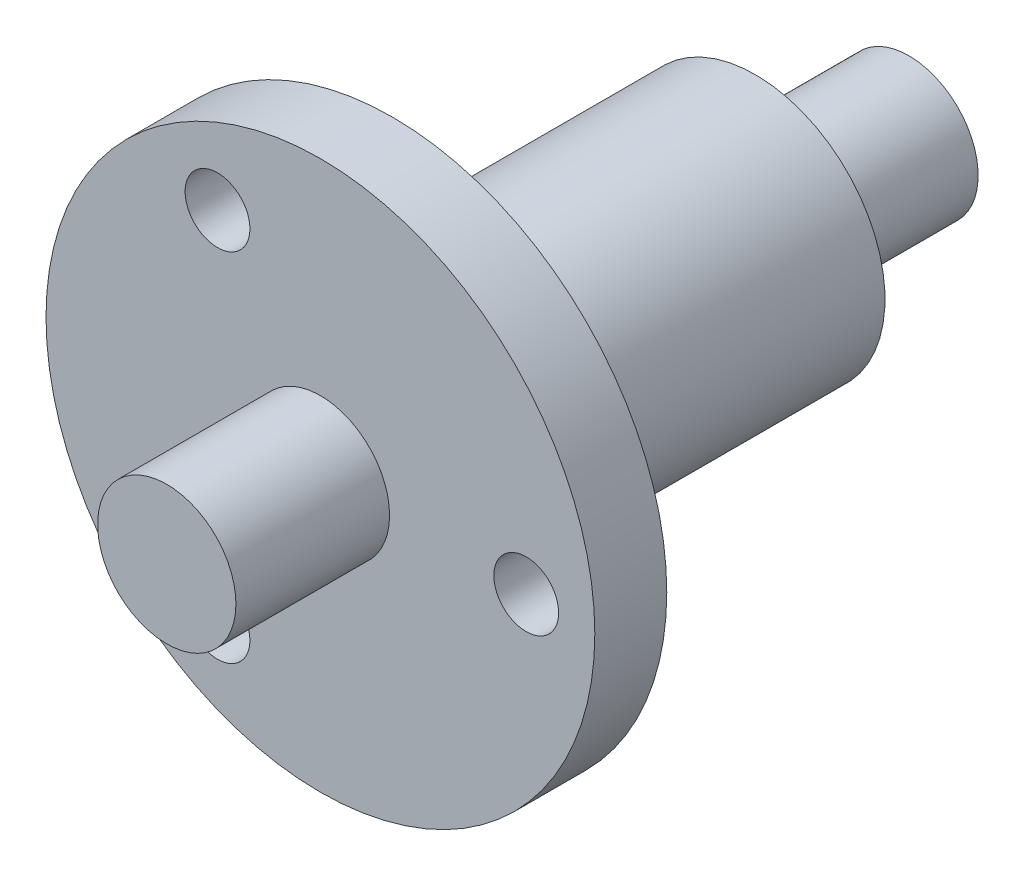
ISO-10303-21;
HEADER;
FILE_DESCRIPTION(('STEP AP214'),'2;1');
FILE_NAME('part.step','',(''),(''),'','','');
FILE_SCHEMA(('AUTOMOTIVE_DESIGN { 1 0 10303 214 1 1 1 1 }'));
ENDSEC;
DATA;
#1=APPLICATION_CONTEXT('core data for automotive mechanical design processes');
#2=APPLICATION_PROTOCOL_DEFINITION('international standard','automotive_design',2000,#1);
#3=PRODUCT_CONTEXT('',#1,'mechanical');
#4=PRODUCT('Part','Part','',(#3));
#5=PRODUCT_RELATED_PRODUCT_CATEGORY('part','',(#4));
#6=PRODUCT_DEFINITION_FORMATION('','',#4);
#7=PRODUCT_DEFINITION_CONTEXT('part definition',#1,'design');
#8=PRODUCT_DEFINITION('design','',#6,#7);
#9=PRODUCT_DEFINITION_SHAPE('','',#8);
#10=(LENGTH_UNIT() NAMED_UNIT(*) SI_UNIT(.MILLI.,.METRE.));
#11=(NAMED_UNIT(*) PLANE_ANGLE_UNIT() SI_UNIT($,.RADIAN.));
#12=(NAMED_UNIT(*) SI_UNIT($,.STERADIAN.) SOLID_ANGLE_UNIT());
#13=UNCERTAINTY_MEASURE_WITH_UNIT(LENGTH_MEASURE(1.E-05),#10,'distance_accuracy_value','');
#14=(GEOMETRIC_REPRESENTATION_CONTEXT(3) GLOBAL_UNCERTAINTY_ASSIGNED_CONTEXT((#13)) GLOBAL_UNIT_ASSIGNED_CONTEXT((#10,
#11,#12)) REPRESENTATION_CONTEXT('',''));
#15=CARTESIAN_POINT('',(0.,0.,0.));
#16=DIRECTION('',(0.,0.,1.));
#17=DIRECTION('',(1.,0.,0.));
#18=AXIS2_PLACEMENT_3D('',#15,#16,#17);
#19=CARTESIAN_POINT('',(0.,0.,3.33));
#20=DIRECTION('',(0.,0.,-1.));
#21=DIRECTION('',(-1.,0.,0.));
#22=AXIS2_PLACEMENT_3D('',#19,#20,#21);
#23=CYLINDRICAL_SURFACE('',#22,12.7);
#24=CARTESIAN_POINT('',(0.,0.,3.33));
#25=DIRECTION('',(0.,0.,1.));
#26=DIRECTION('',(1.,0.,0.));
#27=AXIS2_PLACEMENT_3D('',#24,#25,#26);
#28=CIRCLE('',#27,12.7);
#29=CARTESIAN_POINT('',(12.7,0.,3.33));
#30=VERTEX_POINT('',#29);
#31=EDGE_CURVE('E69',#30,#30,#28,.T.);
#32=ORIENTED_EDGE('',*,*,#31,.F.);
#33=EDGE_LOOP('',(#32));
#34=FACE_BOUND('',#33,.T.);
#35=CARTESIAN_POINT('',(0.,0.,0.));
#36=DIRECTION('',(0.,0.,1.));
#37=DIRECTION('',(1.,0.,0.));
#38=AXIS2_PLACEMENT_3D('',#35,#36,#37);
#39=CIRCLE('',#38,12.7);
#40=CARTESIAN_POINT('',(12.7,0.,0.));
#41=VERTEX_POINT('',#40);
#42=EDGE_CURVE('E65',#41,#41,#39,.T.);
#43=ORIENTED_EDGE('',*,*,#42,.T.);
#44=EDGE_LOOP('',(#43));
#45=FACE_BOUND('',#44,.T.);
#46=ADVANCED_FACE('F37',(#34,#45),#23,.T.);
#47=CARTESIAN_POINT('',(0.,0.,3.33));
#48=DIRECTION('',(0.,0.,1.));
#49=DIRECTION('',(1.,0.,0.));
#50=AXIS2_PLACEMENT_3D('',#47,#48,#49);
#51=PLANE('',#50);
#52=CARTESIAN_POINT('',(9.525,0.,3.33));
#53=DIRECTION('',(0.,0.,1.));
#54=DIRECTION('',(1.,0.,0.));
#55=AXIS2_PLACEMENT_3D('',#52,#53,#54);
#56=CIRCLE('',#55,1.5);
#57=CARTESIAN_POINT('',(11.025,0.,3.33));
#58=VERTEX_POINT('',#57);
#59=EDGE_CURVE('E80',#58,#58,#56,.T.);
#60=ORIENTED_EDGE('',*,*,#59,.F.);
#61=EDGE_LOOP('',(#60));
#62=FACE_BOUND('',#61,.T.);
#63=CARTESIAN_POINT('',(-4.76250000000004,-8.24889197104676,3.33));
#64=DIRECTION('',(0.,0.,1.));
#65=DIRECTION('',(1.,0.,0.));
#66=AXIS2_PLACEMENT_3D('',#63,#64,#65);
#67=CIRCLE('',#66,1.5);
#68=CARTESIAN_POINT('',(-3.26250000000004,-8.24889197104676,3.33));
#69=VERTEX_POINT('',#68);
#70=EDGE_CURVE('E221',#69,#69,#67,.T.);
#71=ORIENTED_EDGE('',*,*,#70,.F.);
#72=EDGE_LOOP('',(#71));
#73=FACE_BOUND('',#72,.T.);
#74=CARTESIAN_POINT('',(-4.76249999999992,8.24889197104682,3.33));
#75=DIRECTION('',(0.,0.,1.));
#76=DIRECTION('',(1.,0.,0.));
#77=AXIS2_PLACEMENT_3D('',#74,#75,#76);
#78=CIRCLE('',#77,1.5);
#79=CARTESIAN_POINT('',(-3.26249999999993,8.24889197104682,3.33));
#80=VERTEX_POINT('',#79);
#81=EDGE_CURVE('E225',#80,#80,#78,.T.);
#82=ORIENTED_EDGE('',*,*,#81,.F.);
#83=EDGE_LOOP('',(#82));
#84=FACE_BOUND('',#83,.T.);
#85=CARTESIAN_POINT('',(0.,0.,3.33));
#86=DIRECTION('',(0.,0.,1.));
#87=DIRECTION('',(1.,0.,0.));
#88=AXIS2_PLACEMENT_3D('',#85,#86,#87);
#89=CIRCLE('',#88,3.2);
#90=CARTESIAN_POINT('',(3.2,0.,3.33));
#91=VERTEX_POINT('',#90);
#92=EDGE_CURVE('E51',#91,#91,#89,.T.);
#93=ORIENTED_EDGE('',*,*,#92,.F.);
#94=EDGE_LOOP('',(#93));
#95=FACE_BOUND('',#94,.T.);
#96=ORIENTED_EDGE('',*,*,#31,.T.);
#97=EDGE_LOOP('',(#96));
#98=FACE_BOUND('',#97,.T.);
#99=ADVANCED_FACE('F109',(#62,#73,#84,#95,#98),#51,.T.);
#100=CARTESIAN_POINT('',(0.,0.,0.));
#101=DIRECTION('',(0.,0.,1.));
#102=DIRECTION('',(1.,0.,0.));
#103=AXIS2_PLACEMENT_3D('',#100,#101,#102);
#104=PLANE('',#103);
#105=CARTESIAN_POINT('',(9.525,0.,0.));
#106=DIRECTION('',(0.,0.,1.));
#107=DIRECTION('',(1.,0.,0.));
#108=AXIS2_PLACEMENT_3D('',#105,#106,#107);
#109=CIRCLE('',#108,1.5);
#110=CARTESIAN_POINT('',(11.025,0.,0.));
#111=VERTEX_POINT('',#110);
#112=EDGE_CURVE('E40',#111,#111,#109,.T.);
#113=ORIENTED_EDGE('',*,*,#112,.T.);
#114=EDGE_LOOP('',(#113));
#115=FACE_BOUND('',#114,.T.);
#116=CARTESIAN_POINT('',(-4.76250000000004,-8.24889197104676,0.));
#117=DIRECTION('',(0.,0.,1.));
#118=DIRECTION('',(1.,0.,0.));
#119=AXIS2_PLACEMENT_3D('',#116,#117,#118);
#120=CIRCLE('',#119,1.5);
#121=CARTESIAN_POINT('',(-3.26250000000004,-8.24889197104676,0.));
#122=VERTEX_POINT('',#121);
#123=EDGE_CURVE('E79',#122,#122,#120,.T.);
#124=ORIENTED_EDGE('',*,*,#123,.T.);
#125=EDGE_LOOP('',(#124));
#126=FACE_BOUND('',#125,.T.);
#127=CARTESIAN_POINT('',(-4.76249999999992,8.24889197104682,0.));
#128=DIRECTION('',(0.,0.,1.));
#129=DIRECTION('',(1.,0.,0.));
#130=AXIS2_PLACEMENT_3D('',#127,#128,#129);
#131=CIRCLE('',#130,1.5);
#132=CARTESIAN_POINT('',(-3.26249999999993,8.24889197104682,0.));
#133=VERTEX_POINT('',#132);
#134=EDGE_CURVE('E76',#133,#133,#131,.T.);
#135=ORIENTED_EDGE('',*,*,#134,.T.);
#136=EDGE_LOOP('',(#135));
#137=FACE_BOUND('',#136,.T.);
#138=CARTESIAN_POINT('',(0.,0.,0.));
#139=DIRECTION('',(0.,0.,-1.));
#140=DIRECTION('',(-1.,0.,0.));
#141=AXIS2_PLACEMENT_3D('',#138,#139,#140);
#142=CIRCLE('',#141,6.);
#143=CARTESIAN_POINT('',(-6.,0.,0.));
#144=VERTEX_POINT('',#143);
#145=EDGE_CURVE('E45',#144,#144,#142,.T.);
#146=ORIENTED_EDGE('',*,*,#145,.F.);
#147=EDGE_LOOP('',(#146));
#148=FACE_BOUND('',#147,.T.);
#149=ORIENTED_EDGE('',*,*,#42,.F.);
#150=EDGE_LOOP('',(#149));
#151=FACE_BOUND('',#150,.T.);
#152=ADVANCED_FACE('F115',(#115,#126,#137,#148,#151),#104,.F.);
#153=CARTESIAN_POINT('',(0.,0.,10.44));
#154=DIRECTION('',(0.,0.,-1.));
#155=DIRECTION('',(-1.,0.,0.));
#156=AXIS2_PLACEMENT_3D('',#153,#154,#155);
#157=CYLINDRICAL_SURFACE('',#156,3.2);
#158=CARTESIAN_POINT('',(0.,0.,10.44));
#159=DIRECTION('',(0.,0.,1.));
#160=DIRECTION('',(1.,0.,0.));
#161=AXIS2_PLACEMENT_3D('',#158,#159,#160);
#162=CIRCLE('',#161,3.2);
#163=CARTESIAN_POINT('',(3.2,0.,10.44));
#164=VERTEX_POINT('',#163);
#165=EDGE_CURVE('E60',#164,#164,#162,.T.);
#166=ORIENTED_EDGE('',*,*,#165,.F.);
#167=EDGE_LOOP('',(#166));
#168=FACE_BOUND('',#167,.T.);
#169=ORIENTED_EDGE('',*,*,#92,.T.);
#170=EDGE_LOOP('',(#169));
#171=FACE_BOUND('',#170,.T.);
#172=ADVANCED_FACE('F123',(#168,#171),#157,.T.);
#173=CARTESIAN_POINT('',(0.,0.,10.44));
#174=DIRECTION('',(0.,0.,1.));
#175=DIRECTION('',(1.,0.,0.));
#176=AXIS2_PLACEMENT_3D('',#173,#174,#175);
#177=PLANE('',#176);
#178=ORIENTED_EDGE('',*,*,#165,.T.);
#179=EDGE_LOOP('',(#178));
#180=FACE_BOUND('',#179,.T.);
#181=ADVANCED_FACE('F128',(#180),#177,.T.);
#182=CARTESIAN_POINT('',(0.,0.,-16.8));
#183=DIRECTION('',(0.,0.,1.));
#184=DIRECTION('',(1.,0.,0.));
#185=AXIS2_PLACEMENT_3D('',#182,#183,#184);
#186=CYLINDRICAL_SURFACE('',#185,6.);
#187=CARTESIAN_POINT('',(0.,0.,-16.8));
#188=DIRECTION('',(0.,0.,-1.));
#189=DIRECTION('',(-1.,0.,0.));
#190=AXIS2_PLACEMENT_3D('',#187,#188,#189);
#191=CIRCLE('',#190,6.);
#192=CARTESIAN_POINT('',(-6.,0.,-16.8));
#193=VERTEX_POINT('',#192);
#194=EDGE_CURVE('E57',#193,#193,#191,.T.);
#195=ORIENTED_EDGE('',*,*,#194,.F.);
#196=EDGE_LOOP('',(#195));
#197=FACE_BOUND('',#196,.T.);
#198=ORIENTED_EDGE('',*,*,#145,.T.);
#199=EDGE_LOOP('',(#198));
#200=FACE_BOUND('',#199,.T.);
#201=ADVANCED_FACE('F105',(#197,#200),#186,.T.);
#202=CARTESIAN_POINT('',(0.,0.,-16.8));
#203=DIRECTION('',(0.,0.,-1.));
#204=DIRECTION('',(-1.,0.,0.));
#205=AXIS2_PLACEMENT_3D('',#202,#203,#204);
#206=PLANE('',#205);
#207=CARTESIAN_POINT('',(0.,0.,-16.8));
#208=DIRECTION('',(0.,0.,-1.));
#209=DIRECTION('',(-1.,0.,0.));
#210=AXIS2_PLACEMENT_3D('',#207,#208,#209);
#211=CIRCLE('',#210,3.2);
#212=CARTESIAN_POINT('',(-3.2,0.,-16.8));
#213=VERTEX_POINT('',#212);
#214=EDGE_CURVE('E10',#213,#213,#211,.T.);
#215=ORIENTED_EDGE('',*,*,#214,.F.);
#216=EDGE_LOOP('',(#215));
#217=FACE_BOUND('',#216,.T.);
#218=ORIENTED_EDGE('',*,*,#194,.T.);
#219=EDGE_LOOP('',(#218));
#220=FACE_BOUND('',#219,.T.);
#221=ADVANCED_FACE('F97',(#217,#220),#206,.T.);
#222=CARTESIAN_POINT('',(0.,0.,-23.91));
#223=DIRECTION('',(0.,0.,1.));
#224=DIRECTION('',(1.,0.,0.));
#225=AXIS2_PLACEMENT_3D('',#222,#223,#224);
#226=CYLINDRICAL_SURFACE('',#225,3.2);
#227=CARTESIAN_POINT('',(0.,0.,-23.91));
#228=DIRECTION('',(0.,0.,-1.));
#229=DIRECTION('',(-1.,0.,0.));
#230=AXIS2_PLACEMENT_3D('',#227,#228,#229);
#231=CIRCLE('',#230,3.2);
#232=CARTESIAN_POINT('',(-3.2,0.,-23.91));
#233=VERTEX_POINT('',#232);
#234=EDGE_CURVE('E55',#233,#233,#231,.T.);
#235=ORIENTED_EDGE('',*,*,#234,.F.);
#236=EDGE_LOOP('',(#235));
#237=FACE_BOUND('',#236,.T.);
#238=ORIENTED_EDGE('',*,*,#214,.T.);
#239=EDGE_LOOP('',(#238));
#240=FACE_BOUND('',#239,.T.);
#241=ADVANCED_FACE('F95',(#237,#240),#226,.T.);
#242=CARTESIAN_POINT('',(0.,0.,-23.91));
#243=DIRECTION('',(0.,0.,-1.));
#244=DIRECTION('',(-1.,0.,0.));
#245=AXIS2_PLACEMENT_3D('',#242,#243,#244);
#246=PLANE('',#245);
#247=ORIENTED_EDGE('',*,*,#234,.T.);
#248=EDGE_LOOP('',(#247));
#249=FACE_BOUND('',#248,.T.);
#250=ADVANCED_FACE('F93',(#249),#246,.T.);
#251=CARTESIAN_POINT('',(-4.76249999999992,8.24889197104682,-3.78));
#252=DIRECTION('',(0.,0.,1.));
#253=DIRECTION('',(1.,0.,0.));
#254=AXIS2_PLACEMENT_3D('',#251,#252,#253);
#255=CYLINDRICAL_SURFACE('',#254,1.5);
#256=ORIENTED_EDGE('',*,*,#81,.T.);
#257=EDGE_LOOP('',(#256));
#258=FACE_BOUND('',#257,.T.);
#259=ORIENTED_EDGE('',*,*,#134,.F.);
#260=EDGE_LOOP('',(#259));
#261=FACE_BOUND('',#260,.T.);
#262=ADVANCED_FACE('F103',(#258,#261),#255,.F.);
#263=CARTESIAN_POINT('',(-4.76250000000004,-8.24889197104676,-3.78));
#264=DIRECTION('',(0.,0.,1.));
#265=DIRECTION('',(1.,0.,0.));
#266=AXIS2_PLACEMENT_3D('',#263,#264,#265);
#267=CYLINDRICAL_SURFACE('',#266,1.5);
#268=ORIENTED_EDGE('',*,*,#70,.T.);
#269=EDGE_LOOP('',(#268));
#270=FACE_BOUND('',#269,.T.);
#271=ORIENTED_EDGE('',*,*,#123,.F.);
#272=EDGE_LOOP('',(#271));
#273=FACE_BOUND('',#272,.T.);
#274=ADVANCED_FACE('F193',(#270,#273),#267,.F.);
#275=CARTESIAN_POINT('',(9.525,0.,-3.78));
#276=DIRECTION('',(0.,0.,1.));
#277=DIRECTION('',(1.,0.,0.));
#278=AXIS2_PLACEMENT_3D('',#275,#276,#277);
#279=CYLINDRICAL_SURFACE('',#278,1.5);
#280=ORIENTED_EDGE('',*,*,#59,.T.);
#281=EDGE_LOOP('',(#280));
#282=FACE_BOUND('',#281,.T.);
#283=ORIENTED_EDGE('',*,*,#112,.F.);
#284=EDGE_LOOP('',(#283));
#285=FACE_BOUND('',#284,.T.);
#286=ADVANCED_FACE('F200',(#282,#285),#279,.F.);
#287=CLOSED_SHELL('',(#46,#99,#152,#172,#181,#201,#221,#241,#250,#262,#274,#286));
#288=MANIFOLD_SOLID_BREP('B2',#287);
#289=ADVANCED_BREP_SHAPE_REPRESENTATION('',(#18,#288),#14);
#290=SHAPE_DEFINITION_REPRESENTATION(#9,#289);
ENDSEC;
END-ISO-10303-21;
